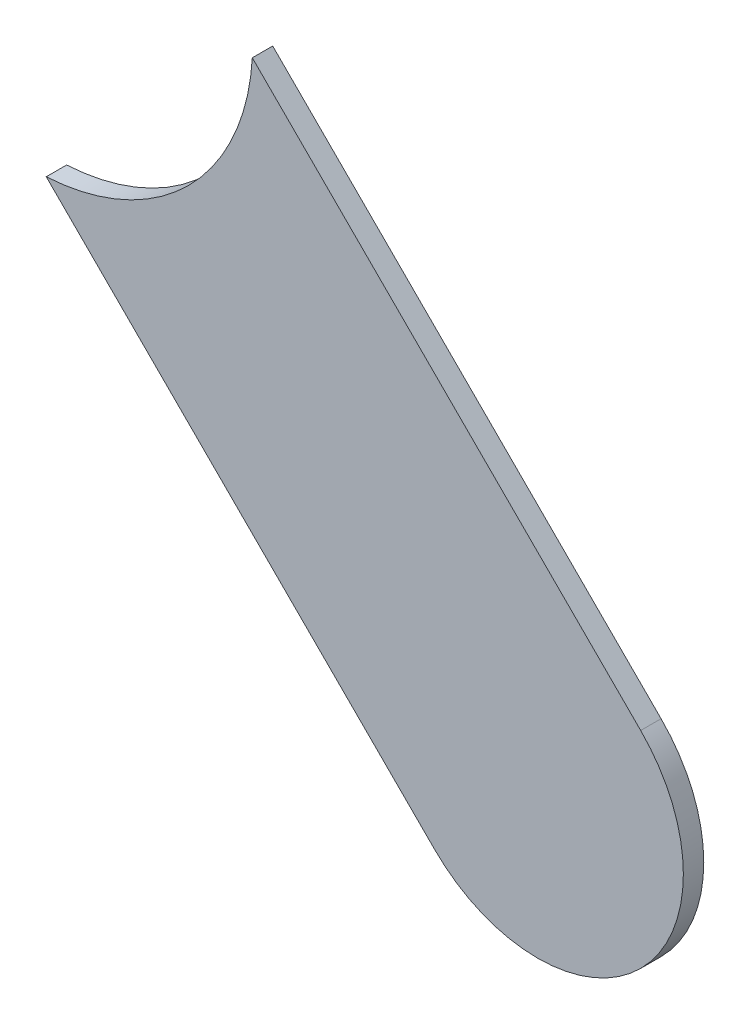
ISO-10303-21;
HEADER;
FILE_DESCRIPTION(('STEP AP214'),'2;1');
FILE_NAME('part.step','',(''),(''),'','','');
FILE_SCHEMA(('AUTOMOTIVE_DESIGN { 1 0 10303 214 1 1 1 1 }'));
ENDSEC;
DATA;
#1=APPLICATION_CONTEXT('core data for automotive mechanical design processes');
#2=APPLICATION_PROTOCOL_DEFINITION('international standard','automotive_design',2000,#1);
#3=PRODUCT_CONTEXT('',#1,'mechanical');
#4=PRODUCT('Part','Part','',(#3));
#5=PRODUCT_RELATED_PRODUCT_CATEGORY('part','',(#4));
#6=PRODUCT_DEFINITION_FORMATION('','',#4);
#7=PRODUCT_DEFINITION_CONTEXT('part definition',#1,'design');
#8=PRODUCT_DEFINITION('design','',#6,#7);
#9=PRODUCT_DEFINITION_SHAPE('','',#8);
#10=(LENGTH_UNIT() NAMED_UNIT(*) SI_UNIT(.MILLI.,.METRE.));
#11=(NAMED_UNIT(*) PLANE_ANGLE_UNIT() SI_UNIT($,.RADIAN.));
#12=(NAMED_UNIT(*) SI_UNIT($,.STERADIAN.) SOLID_ANGLE_UNIT());
#13=UNCERTAINTY_MEASURE_WITH_UNIT(LENGTH_MEASURE(1.E-05),#10,'distance_accuracy_value','');
#14=(GEOMETRIC_REPRESENTATION_CONTEXT(3) GLOBAL_UNCERTAINTY_ASSIGNED_CONTEXT((#13)) GLOBAL_UNIT_ASSIGNED_CONTEXT((#10,
#11,#12)) REPRESENTATION_CONTEXT('',''));
#15=CARTESIAN_POINT('',(0.,0.,0.));
#16=DIRECTION('',(0.,0.,1.));
#17=DIRECTION('',(1.,0.,0.));
#18=AXIS2_PLACEMENT_3D('',#15,#16,#17);
#19=CARTESIAN_POINT('',(177.316779,-106.351226,-0.035));
#20=DIRECTION('',(-0.707106781186548,-0.707106781186548,0.));
#21=DIRECTION('',(-0.707106781186548,0.707106781186548,0.));
#22=AXIS2_PLACEMENT_3D('',#19,#20,#21);
#23=PLANE('',#22);
#24=DIRECTION('',(0.,0.,-1.));
#25=VECTOR('',#24,1.);
#26=CARTESIAN_POINT('',(176.65041902843,-105.6848660284,-0.045));
#27=LINE('',#26,#25);
#28=CARTESIAN_POINT('',(176.65041902842,-105.6848660284,0.));
#29=VERTEX_POINT('',#28);
#30=CARTESIAN_POINT('',(176.65041902842,-105.6848660284,-0.035));
#31=VERTEX_POINT('',#30);
#32=EDGE_CURVE('E11',#29,#31,#27,.T.);
#33=ORIENTED_EDGE('',*,*,#32,.F.);
#34=DIRECTION('',(-0.707106781186548,0.707106781186548,0.));
#35=VECTOR('',#34,1.);
#36=CARTESIAN_POINT('',(177.316779,-106.351226,0.));
#37=LINE('',#36,#35);
#38=CARTESIAN_POINT('',(177.316779,-106.351226,0.));
#39=VERTEX_POINT('',#38);
#40=EDGE_CURVE('E26',#39,#29,#37,.T.);
#41=ORIENTED_EDGE('',*,*,#40,.F.);
#42=DIRECTION('',(0.,0.,1.));
#43=VECTOR('',#42,1.);
#44=CARTESIAN_POINT('',(177.316779,-106.351226,-0.035));
#45=LINE('',#44,#43);
#46=CARTESIAN_POINT('',(177.316779,-106.351226,-0.035));
#47=VERTEX_POINT('',#46);
#48=EDGE_CURVE('E67',#47,#39,#45,.T.);
#49=ORIENTED_EDGE('',*,*,#48,.F.);
#50=DIRECTION('',(-0.707106781186548,0.707106781186548,0.));
#51=VECTOR('',#50,1.);
#52=CARTESIAN_POINT('',(177.316779,-106.351226,-0.035));
#53=LINE('',#52,#51);
#54=EDGE_CURVE('E70',#47,#31,#53,.T.);
#55=ORIENTED_EDGE('',*,*,#54,.T.);
#56=EDGE_LOOP('',(#33,#41,#49,#55));
#57=FACE_BOUND('',#56,.T.);
#58=ADVANCED_FACE('F17',(#57),#23,.F.);
#59=CARTESIAN_POINT('',(176.276,-105.664,-0.045));
#60=DIRECTION('',(0.,0.,-1.));
#61=DIRECTION('',(0.,-1.,0.));
#62=AXIS2_PLACEMENT_3D('',#59,#60,#61);
#63=CYLINDRICAL_SURFACE('',#62,0.375);
#64=DIRECTION('',(0.,0.,-1.));
#65=VECTOR('',#64,1.);
#66=CARTESIAN_POINT('',(176.29686602843,-106.0384190284,-0.045));
#67=LINE('',#66,#65);
#68=CARTESIAN_POINT('',(176.29686602842,-106.0384190284,0.));
#69=VERTEX_POINT('',#68);
#70=CARTESIAN_POINT('',(176.29686602842,-106.0384190284,-0.035));
#71=VERTEX_POINT('',#70);
#72=EDGE_CURVE('E93',#69,#71,#67,.T.);
#73=ORIENTED_EDGE('',*,*,#72,.F.);
#74=CARTESIAN_POINT('',(176.276,-105.664,0.));
#75=DIRECTION('',(0.,0.,-1.));
#76=DIRECTION('',(0.,-1.,0.));
#77=AXIS2_PLACEMENT_3D('',#74,#75,#76);
#78=CIRCLE('',#77,0.375);
#79=EDGE_CURVE('E97',#29,#69,#78,.T.);
#80=ORIENTED_EDGE('',*,*,#79,.F.);
#81=ORIENTED_EDGE('',*,*,#32,.T.);
#82=CARTESIAN_POINT('',(176.276,-105.664,-0.035));
#83=DIRECTION('',(0.,0.,-1.));
#84=DIRECTION('',(0.,-1.,0.));
#85=AXIS2_PLACEMENT_3D('',#82,#83,#84);
#86=CIRCLE('',#85,0.375);
#87=EDGE_CURVE('E73',#31,#71,#86,.T.);
#88=ORIENTED_EDGE('',*,*,#87,.T.);
#89=EDGE_LOOP('',(#73,#80,#81,#88));
#90=FACE_BOUND('',#89,.T.);
#91=ADVANCED_FACE('F107',(#90),#63,.F.);
#92=CARTESIAN_POINT('',(176.099223,-105.840776,0.));
#93=DIRECTION('',(0.,0.,1.));
#94=DIRECTION('',(1.,0.,0.));
#95=AXIS2_PLACEMENT_3D('',#92,#93,#94);
#96=PLANE('',#95);
#97=ORIENTED_EDGE('',*,*,#79,.T.);
#98=DIRECTION('',(0.707106781186548,-0.707106781186548,0.));
#99=VECTOR('',#98,1.);
#100=CARTESIAN_POINT('',(176.099223,-105.840776,0.));
#101=LINE('',#100,#99);
#102=CARTESIAN_POINT('',(176.963226,-106.704779,0.));
#103=VERTEX_POINT('',#102);
#104=EDGE_CURVE('E114',#69,#103,#101,.T.);
#105=ORIENTED_EDGE('',*,*,#104,.T.);
#106=CARTESIAN_POINT('',(177.1400025,-106.5280025,0.));
#107=DIRECTION('',(0.,0.,1.));
#108=DIRECTION('',(-0.707106781186548,-0.707106781186548,0.));
#109=AXIS2_PLACEMENT_3D('',#106,#107,#108);
#110=CIRCLE('',#109,0.249999723809);
#111=EDGE_CURVE('E20',#103,#39,#110,.T.);
#112=ORIENTED_EDGE('',*,*,#111,.T.);
#113=ORIENTED_EDGE('',*,*,#40,.T.);
#114=EDGE_LOOP('',(#97,#105,#112,#113));
#115=FACE_BOUND('',#114,.T.);
#116=ADVANCED_FACE('F175',(#115),#96,.T.);
#117=CARTESIAN_POINT('',(177.1400025,-106.5280025,-0.035));
#118=DIRECTION('',(0.,0.,-1.));
#119=DIRECTION('',(-0.707106781186548,-0.707106781186548,0.));
#120=AXIS2_PLACEMENT_3D('',#117,#118,#119);
#121=CYLINDRICAL_SURFACE('',#120,0.249999723809);
#122=CARTESIAN_POINT('',(177.1400025,-106.5280025,-0.035));
#123=DIRECTION('',(0.,0.,1.));
#124=DIRECTION('',(-0.707106781186548,-0.707106781186548,0.));
#125=AXIS2_PLACEMENT_3D('',#122,#123,#124);
#126=CIRCLE('',#125,0.249999723809);
#127=CARTESIAN_POINT('',(176.963226,-106.704779,-0.035));
#128=VERTEX_POINT('',#127);
#129=EDGE_CURVE('E75',#128,#47,#126,.T.);
#130=ORIENTED_EDGE('',*,*,#129,.T.);
#131=ORIENTED_EDGE('',*,*,#48,.T.);
#132=ORIENTED_EDGE('',*,*,#111,.F.);
#133=DIRECTION('',(0.,0.,1.));
#134=VECTOR('',#133,1.);
#135=CARTESIAN_POINT('',(176.963226,-106.704779,-0.035));
#136=LINE('',#135,#134);
#137=EDGE_CURVE('E78',#128,#103,#136,.T.);
#138=ORIENTED_EDGE('',*,*,#137,.F.);
#139=EDGE_LOOP('',(#130,#131,#132,#138));
#140=FACE_BOUND('',#139,.T.);
#141=ADVANCED_FACE('F76',(#140),#121,.T.);
#142=CARTESIAN_POINT('',(176.099223,-105.840776,-0.035));
#143=DIRECTION('',(0.,0.,1.));
#144=DIRECTION('',(1.,0.,0.));
#145=AXIS2_PLACEMENT_3D('',#142,#143,#144);
#146=PLANE('',#145);
#147=ORIENTED_EDGE('',*,*,#54,.F.);
#148=ORIENTED_EDGE('',*,*,#129,.F.);
#149=DIRECTION('',(0.707106781186548,-0.707106781186548,0.));
#150=VECTOR('',#149,1.);
#151=CARTESIAN_POINT('',(176.099223,-105.840776,-0.035));
#152=LINE('',#151,#150);
#153=EDGE_CURVE('E87',#71,#128,#152,.T.);
#154=ORIENTED_EDGE('',*,*,#153,.F.);
#155=ORIENTED_EDGE('',*,*,#87,.F.);
#156=EDGE_LOOP('',(#147,#148,#154,#155));
#157=FACE_BOUND('',#156,.T.);
#158=ADVANCED_FACE('F85',(#157),#146,.F.);
#159=CARTESIAN_POINT('',(176.099223,-105.840776,-0.035));
#160=DIRECTION('',(0.707106781186548,0.707106781186548,0.));
#161=DIRECTION('',(0.,0.,-1.));
#162=AXIS2_PLACEMENT_3D('',#159,#160,#161);
#163=PLANE('',#162);
#164=ORIENTED_EDGE('',*,*,#137,.T.);
#165=ORIENTED_EDGE('',*,*,#104,.F.);
#166=ORIENTED_EDGE('',*,*,#72,.T.);
#167=ORIENTED_EDGE('',*,*,#153,.T.);
#168=EDGE_LOOP('',(#164,#165,#166,#167));
#169=FACE_BOUND('',#168,.T.);
#170=ADVANCED_FACE('F112',(#169),#163,.F.);
#171=CLOSED_SHELL('',(#58,#91,#116,#141,#158,#170));
#172=MANIFOLD_SOLID_BREP('B1',#171);
#173=ADVANCED_BREP_SHAPE_REPRESENTATION('',(#18,#172),#14);
#174=SHAPE_DEFINITION_REPRESENTATION(#9,#173);
ENDSEC;
END-ISO-10303-21;
